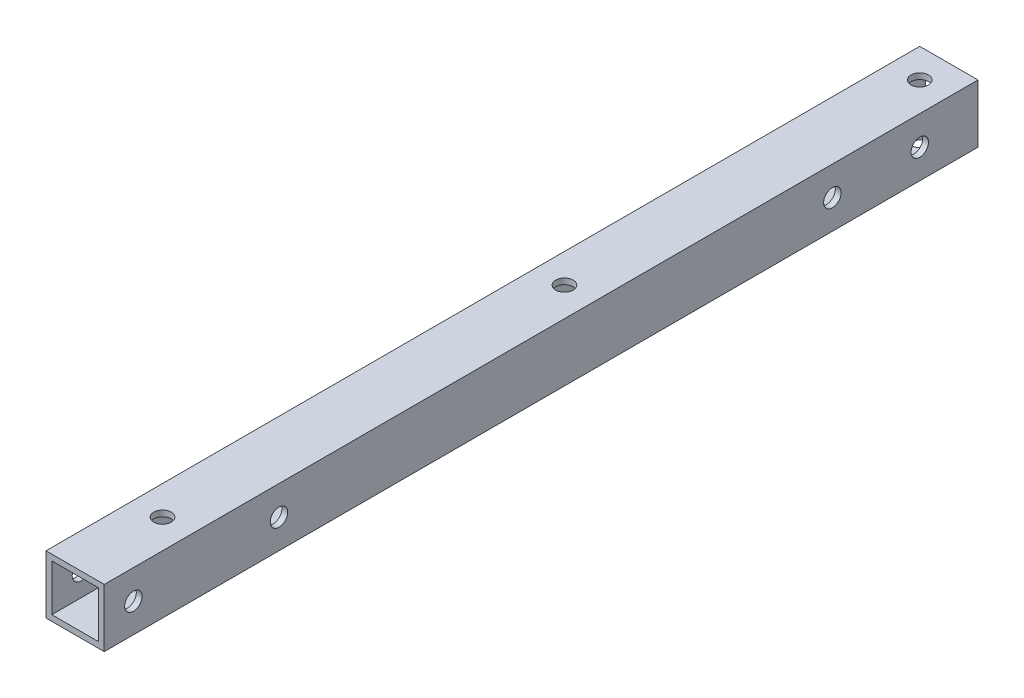
ISO-10303-21;
HEADER;
FILE_DESCRIPTION(('STEP AP214'),'2;1');
FILE_NAME('part.step','',(''),(''),'','','');
FILE_SCHEMA(('AUTOMOTIVE_DESIGN { 1 0 10303 214 1 1 1 1 }'));
ENDSEC;
DATA;
#1=APPLICATION_CONTEXT('core data for automotive mechanical design processes');
#2=APPLICATION_PROTOCOL_DEFINITION('international standard','automotive_design',2000,#1);
#3=PRODUCT_CONTEXT('',#1,'mechanical');
#4=PRODUCT('Part','Part','',(#3));
#5=PRODUCT_RELATED_PRODUCT_CATEGORY('part','',(#4));
#6=PRODUCT_DEFINITION_FORMATION('','',#4);
#7=PRODUCT_DEFINITION_CONTEXT('part definition',#1,'design');
#8=PRODUCT_DEFINITION('design','',#6,#7);
#9=PRODUCT_DEFINITION_SHAPE('','',#8);
#10=(LENGTH_UNIT() NAMED_UNIT(*) SI_UNIT(.MILLI.,.METRE.));
#11=(NAMED_UNIT(*) PLANE_ANGLE_UNIT() SI_UNIT($,.RADIAN.));
#12=(NAMED_UNIT(*) SI_UNIT($,.STERADIAN.) SOLID_ANGLE_UNIT());
#13=UNCERTAINTY_MEASURE_WITH_UNIT(LENGTH_MEASURE(1.E-05),#10,'distance_accuracy_value','');
#14=(GEOMETRIC_REPRESENTATION_CONTEXT(3) GLOBAL_UNCERTAINTY_ASSIGNED_CONTEXT((#13)) GLOBAL_UNIT_ASSIGNED_CONTEXT((#10,
#11,#12)) REPRESENTATION_CONTEXT('',''));
#15=CARTESIAN_POINT('',(0.,0.,0.));
#16=DIRECTION('',(0.,0.,1.));
#17=DIRECTION('',(1.,0.,0.));
#18=AXIS2_PLACEMENT_3D('',#15,#16,#17);
#19=CARTESIAN_POINT('',(0.,0.,150.));
#20=DIRECTION('',(0.,0.,1.));
#21=DIRECTION('',(1.,0.,0.));
#22=AXIS2_PLACEMENT_3D('',#19,#20,#21);
#23=PLANE('',#22);
#24=DIRECTION('',(0.,1.,0.));
#25=VECTOR('',#24,1.);
#26=CARTESIAN_POINT('',(9.16108929283946,-154.11274533603,150.));
#27=LINE('',#26,#25);
#28=CARTESIAN_POINT('',(9.16108929283946,-164.11274533603,150.));
#29=VERTEX_POINT('',#28);
#30=CARTESIAN_POINT('',(9.16108929283946,-154.11274533603,150.));
#31=VERTEX_POINT('',#30);
#32=EDGE_CURVE('E168',#29,#31,#27,.T.);
#33=ORIENTED_EDGE('',*,*,#32,.T.);
#34=DIRECTION('',(-1.,0.,0.));
#35=VECTOR('',#34,1.);
#36=CARTESIAN_POINT('',(9.16108929283946,-154.11274533603,150.));
#37=LINE('',#36,#35);
#38=CARTESIAN_POINT('',(-0.838910707160541,-154.11274533603,150.));
#39=VERTEX_POINT('',#38);
#40=EDGE_CURVE('E171',#31,#39,#37,.T.);
#41=ORIENTED_EDGE('',*,*,#40,.T.);
#42=DIRECTION('',(0.,-1.,0.));
#43=VECTOR('',#42,1.);
#44=CARTESIAN_POINT('',(-0.838910707160541,-154.11274533603,150.));
#45=LINE('',#44,#43);
#46=CARTESIAN_POINT('',(-0.838910707160538,-164.11274533603,150.));
#47=VERTEX_POINT('',#46);
#48=EDGE_CURVE('E174',#39,#47,#45,.T.);
#49=ORIENTED_EDGE('',*,*,#48,.T.);
#50=DIRECTION('',(1.,0.,0.));
#51=VECTOR('',#50,1.);
#52=CARTESIAN_POINT('',(9.16108929283946,-164.11274533603,150.));
#53=LINE('',#52,#51);
#54=EDGE_CURVE('E176',#47,#29,#53,.T.);
#55=ORIENTED_EDGE('',*,*,#54,.T.);
#56=EDGE_LOOP('',(#33,#41,#49,#55));
#57=FACE_BOUND('',#56,.T.);
#58=DIRECTION('',(-1.,0.,0.));
#59=VECTOR('',#58,1.);
#60=CARTESIAN_POINT('',(0.,-155.11274533603,150.));
#61=LINE('',#60,#59);
#62=CARTESIAN_POINT('',(8.16108929283946,-155.11274533603,150.));
#63=VERTEX_POINT('',#62);
#64=CARTESIAN_POINT('',(0.161089292839459,-155.11274533603,150.));
#65=VERTEX_POINT('',#64);
#66=EDGE_CURVE('E138',#63,#65,#61,.T.);
#67=ORIENTED_EDGE('',*,*,#66,.F.);
#68=DIRECTION('',(0.,1.,0.));
#69=VECTOR('',#68,1.);
#70=CARTESIAN_POINT('',(8.16108929283946,0.,150.));
#71=LINE('',#70,#69);
#72=CARTESIAN_POINT('',(8.16108929283946,-163.11274533603,150.));
#73=VERTEX_POINT('',#72);
#74=EDGE_CURVE('E130',#73,#63,#71,.T.);
#75=ORIENTED_EDGE('',*,*,#74,.F.);
#76=DIRECTION('',(1.,0.,0.));
#77=VECTOR('',#76,1.);
#78=CARTESIAN_POINT('',(0.,-163.11274533603,150.));
#79=LINE('',#78,#77);
#80=CARTESIAN_POINT('',(0.161089292839462,-163.11274533603,150.));
#81=VERTEX_POINT('',#80);
#82=EDGE_CURVE('E152',#81,#73,#79,.T.);
#83=ORIENTED_EDGE('',*,*,#82,.F.);
#84=DIRECTION('',(0.,-1.,0.));
#85=VECTOR('',#84,1.);
#86=CARTESIAN_POINT('',(0.161089292839405,0.,150.));
#87=LINE('',#86,#85);
#88=EDGE_CURVE('E150',#65,#81,#87,.T.);
#89=ORIENTED_EDGE('',*,*,#88,.F.);
#90=EDGE_LOOP('',(#67,#75,#83,#89));
#91=FACE_BOUND('',#90,.T.);
#92=ADVANCED_FACE('F63',(#57,#91),#23,.T.);
#93=CARTESIAN_POINT('',(0.,0.,0.));
#94=DIRECTION('',(0.,0.,1.));
#95=DIRECTION('',(1.,0.,0.));
#96=AXIS2_PLACEMENT_3D('',#93,#94,#95);
#97=PLANE('',#96);
#98=DIRECTION('',(0.,1.,0.));
#99=VECTOR('',#98,1.);
#100=CARTESIAN_POINT('',(9.16108929283946,-154.11274533603,0.));
#101=LINE('',#100,#99);
#102=CARTESIAN_POINT('',(9.16108929283946,-164.11274533603,0.));
#103=VERTEX_POINT('',#102);
#104=CARTESIAN_POINT('',(9.16108929283946,-154.11274533603,0.));
#105=VERTEX_POINT('',#104);
#106=EDGE_CURVE('E146',#103,#105,#101,.T.);
#107=ORIENTED_EDGE('',*,*,#106,.F.);
#108=DIRECTION('',(1.,0.,0.));
#109=VECTOR('',#108,1.);
#110=CARTESIAN_POINT('',(9.16108929283946,-164.11274533603,0.));
#111=LINE('',#110,#109);
#112=CARTESIAN_POINT('',(-0.838910707160538,-164.11274533603,0.));
#113=VERTEX_POINT('',#112);
#114=EDGE_CURVE('E172',#113,#103,#111,.T.);
#115=ORIENTED_EDGE('',*,*,#114,.F.);
#116=DIRECTION('',(0.,-1.,0.));
#117=VECTOR('',#116,1.);
#118=CARTESIAN_POINT('',(-0.838910707160541,-154.11274533603,0.));
#119=LINE('',#118,#117);
#120=CARTESIAN_POINT('',(-0.838910707160541,-154.11274533603,0.));
#121=VERTEX_POINT('',#120);
#122=EDGE_CURVE('E183',#121,#113,#119,.T.);
#123=ORIENTED_EDGE('',*,*,#122,.F.);
#124=DIRECTION('',(-1.,0.,0.));
#125=VECTOR('',#124,1.);
#126=CARTESIAN_POINT('',(9.16108929283946,-154.11274533603,0.));
#127=LINE('',#126,#125);
#128=EDGE_CURVE('E181',#105,#121,#127,.T.);
#129=ORIENTED_EDGE('',*,*,#128,.F.);
#130=EDGE_LOOP('',(#107,#115,#123,#129));
#131=FACE_BOUND('',#130,.T.);
#132=DIRECTION('',(0.,1.,0.));
#133=VECTOR('',#132,1.);
#134=CARTESIAN_POINT('',(8.16108929283946,0.,0.));
#135=LINE('',#134,#133);
#136=CARTESIAN_POINT('',(8.16108929283946,-163.11274533603,0.));
#137=VERTEX_POINT('',#136);
#138=CARTESIAN_POINT('',(8.16108929283946,-155.11274533603,0.));
#139=VERTEX_POINT('',#138);
#140=EDGE_CURVE('E88',#137,#139,#135,.T.);
#141=ORIENTED_EDGE('',*,*,#140,.T.);
#142=DIRECTION('',(-1.,0.,0.));
#143=VECTOR('',#142,1.);
#144=CARTESIAN_POINT('',(0.,-155.11274533603,0.));
#145=LINE('',#144,#143);
#146=CARTESIAN_POINT('',(0.161089292839459,-155.11274533603,0.));
#147=VERTEX_POINT('',#146);
#148=EDGE_CURVE('E145',#139,#147,#145,.T.);
#149=ORIENTED_EDGE('',*,*,#148,.T.);
#150=DIRECTION('',(0.,-1.,0.));
#151=VECTOR('',#150,1.);
#152=CARTESIAN_POINT('',(0.161089292839405,0.,0.));
#153=LINE('',#152,#151);
#154=CARTESIAN_POINT('',(0.161089292839462,-163.11274533603,0.));
#155=VERTEX_POINT('',#154);
#156=EDGE_CURVE('E160',#147,#155,#153,.T.);
#157=ORIENTED_EDGE('',*,*,#156,.T.);
#158=DIRECTION('',(1.,0.,0.));
#159=VECTOR('',#158,1.);
#160=CARTESIAN_POINT('',(0.,-163.11274533603,0.));
#161=LINE('',#160,#159);
#162=EDGE_CURVE('E139',#155,#137,#161,.T.);
#163=ORIENTED_EDGE('',*,*,#162,.T.);
#164=EDGE_LOOP('',(#141,#149,#157,#163));
#165=FACE_BOUND('',#164,.T.);
#166=ADVANCED_FACE('F287',(#131,#165),#97,.F.);
#167=CARTESIAN_POINT('',(9.16108929283946,-154.11274533603,150.));
#168=DIRECTION('',(-1.,0.,0.));
#169=DIRECTION('',(0.,0.,1.));
#170=AXIS2_PLACEMENT_3D('',#167,#168,#169);
#171=PLANE('',#170);
#172=CARTESIAN_POINT('',(9.16108929283946,-159.11274533603,145.));
#173=DIRECTION('',(1.,0.,0.));
#174=DIRECTION('',(0.,0.,-1.));
#175=AXIS2_PLACEMENT_3D('',#172,#173,#174);
#176=CIRCLE('',#175,1.5);
#177=CARTESIAN_POINT('',(9.16108929283946,-159.11274533603,143.5));
#178=VERTEX_POINT('',#177);
#179=EDGE_CURVE('E332',#178,#178,#176,.T.);
#180=ORIENTED_EDGE('',*,*,#179,.F.);
#181=EDGE_LOOP('',(#180));
#182=FACE_BOUND('',#181,.T.);
#183=CARTESIAN_POINT('',(9.16108929283946,-159.11274533603,120.));
#184=DIRECTION('',(1.,0.,0.));
#185=DIRECTION('',(0.,0.,-1.));
#186=AXIS2_PLACEMENT_3D('',#183,#184,#185);
#187=CIRCLE('',#186,1.49999999999978);
#188=CARTESIAN_POINT('',(9.16108929283946,-159.11274533603,118.5));
#189=VERTEX_POINT('',#188);
#190=EDGE_CURVE('E336',#189,#189,#187,.T.);
#191=ORIENTED_EDGE('',*,*,#190,.F.);
#192=EDGE_LOOP('',(#191));
#193=FACE_BOUND('',#192,.T.);
#194=CARTESIAN_POINT('',(9.16108929283946,-159.11274533603,10.));
#195=DIRECTION('',(1.,0.,0.));
#196=DIRECTION('',(0.,0.,-1.));
#197=AXIS2_PLACEMENT_3D('',#194,#195,#196);
#198=CIRCLE('',#197,1.5);
#199=CARTESIAN_POINT('',(9.16108929283946,-159.11274533603,8.5));
#200=VERTEX_POINT('',#199);
#201=EDGE_CURVE('E329',#200,#200,#198,.T.);
#202=ORIENTED_EDGE('',*,*,#201,.F.);
#203=EDGE_LOOP('',(#202));
#204=FACE_BOUND('',#203,.T.);
#205=CARTESIAN_POINT('',(9.16108929283946,-159.11274533603,25.));
#206=DIRECTION('',(1.,0.,0.));
#207=DIRECTION('',(0.,0.,-1.));
#208=AXIS2_PLACEMENT_3D('',#205,#206,#207);
#209=CIRCLE('',#208,1.5);
#210=CARTESIAN_POINT('',(9.16108929283946,-159.11274533603,23.5));
#211=VERTEX_POINT('',#210);
#212=EDGE_CURVE('E326',#211,#211,#209,.T.);
#213=ORIENTED_EDGE('',*,*,#212,.F.);
#214=EDGE_LOOP('',(#213));
#215=FACE_BOUND('',#214,.T.);
#216=ORIENTED_EDGE('',*,*,#106,.T.);
#217=DIRECTION('',(0.,0.,-1.));
#218=VECTOR('',#217,1.);
#219=CARTESIAN_POINT('',(9.16108929283946,-154.11274533603,150.));
#220=LINE('',#219,#218);
#221=EDGE_CURVE('E12',#31,#105,#220,.T.);
#222=ORIENTED_EDGE('',*,*,#221,.F.);
#223=ORIENTED_EDGE('',*,*,#32,.F.);
#224=DIRECTION('',(0.,0.,-1.));
#225=VECTOR('',#224,1.);
#226=CARTESIAN_POINT('',(9.16108929283946,-164.11274533603,150.));
#227=LINE('',#226,#225);
#228=EDGE_CURVE('E178',#29,#103,#227,.T.);
#229=ORIENTED_EDGE('',*,*,#228,.T.);
#230=EDGE_LOOP('',(#216,#222,#223,#229));
#231=FACE_BOUND('',#230,.T.);
#232=ADVANCED_FACE('F65',(#182,#193,#204,#215,#231),#171,.F.);
#233=CARTESIAN_POINT('',(9.16108929283946,-154.11274533603,150.));
#234=DIRECTION('',(0.,-1.,0.));
#235=DIRECTION('',(0.,0.,-1.));
#236=AXIS2_PLACEMENT_3D('',#233,#234,#235);
#237=PLANE('',#236);
#238=CARTESIAN_POINT('',(4.16108929283948,-154.11274533603,5.));
#239=DIRECTION('',(0.,-1.,0.));
#240=DIRECTION('',(0.,0.,-1.));
#241=AXIS2_PLACEMENT_3D('',#238,#239,#240);
#242=CIRCLE('',#241,1.5);
#243=CARTESIAN_POINT('',(4.16108929283948,-154.11274533603,3.5));
#244=VERTEX_POINT('',#243);
#245=EDGE_CURVE('E197',#244,#244,#242,.T.);
#246=ORIENTED_EDGE('',*,*,#245,.T.);
#247=EDGE_LOOP('',(#246));
#248=FACE_BOUND('',#247,.T.);
#249=CARTESIAN_POINT('',(4.16108929283946,-154.11274533603,135.));
#250=DIRECTION('',(0.,-1.,0.));
#251=DIRECTION('',(0.,0.,-1.));
#252=AXIS2_PLACEMENT_3D('',#249,#250,#251);
#253=CIRCLE('',#252,1.5);
#254=CARTESIAN_POINT('',(4.16108929283946,-154.11274533603,133.5));
#255=VERTEX_POINT('',#254);
#256=EDGE_CURVE('E239',#255,#255,#253,.T.);
#257=ORIENTED_EDGE('',*,*,#256,.T.);
#258=EDGE_LOOP('',(#257));
#259=FACE_BOUND('',#258,.T.);
#260=CARTESIAN_POINT('',(4.16108929283947,-154.11274533603,66.));
#261=DIRECTION('',(0.,-1.,0.));
#262=DIRECTION('',(0.,0.,-1.));
#263=AXIS2_PLACEMENT_3D('',#260,#261,#262);
#264=CIRCLE('',#263,1.5);
#265=CARTESIAN_POINT('',(4.16108929283947,-154.11274533603,64.5));
#266=VERTEX_POINT('',#265);
#267=EDGE_CURVE('E230',#266,#266,#264,.T.);
#268=ORIENTED_EDGE('',*,*,#267,.T.);
#269=EDGE_LOOP('',(#268));
#270=FACE_BOUND('',#269,.T.);
#271=ORIENTED_EDGE('',*,*,#128,.T.);
#272=DIRECTION('',(0.,0.,-1.));
#273=VECTOR('',#272,1.);
#274=CARTESIAN_POINT('',(-0.838910707160541,-154.11274533603,150.));
#275=LINE('',#274,#273);
#276=EDGE_CURVE('E72',#39,#121,#275,.T.);
#277=ORIENTED_EDGE('',*,*,#276,.F.);
#278=ORIENTED_EDGE('',*,*,#40,.F.);
#279=ORIENTED_EDGE('',*,*,#221,.T.);
#280=EDGE_LOOP('',(#271,#277,#278,#279));
#281=FACE_BOUND('',#280,.T.);
#282=ADVANCED_FACE('F273',(#248,#259,#270,#281),#237,.F.);
#283=CARTESIAN_POINT('',(-0.838910707160541,-154.11274533603,150.));
#284=DIRECTION('',(1.,0.,0.));
#285=DIRECTION('',(0.,1.,0.));
#286=AXIS2_PLACEMENT_3D('',#283,#284,#285);
#287=PLANE('',#286);
#288=CARTESIAN_POINT('',(-0.83891070716054,-159.11274533603,145.));
#289=DIRECTION('',(1.,0.,0.));
#290=DIRECTION('',(0.,0.,-1.));
#291=AXIS2_PLACEMENT_3D('',#288,#289,#290);
#292=CIRCLE('',#291,1.5);
#293=CARTESIAN_POINT('',(-0.83891070716054,-159.11274533603,143.5));
#294=VERTEX_POINT('',#293);
#295=EDGE_CURVE('E314',#294,#294,#292,.T.);
#296=ORIENTED_EDGE('',*,*,#295,.T.);
#297=EDGE_LOOP('',(#296));
#298=FACE_BOUND('',#297,.T.);
#299=CARTESIAN_POINT('',(-0.83891070716054,-159.11274533603,120.));
#300=DIRECTION('',(1.,0.,0.));
#301=DIRECTION('',(0.,0.,-1.));
#302=AXIS2_PLACEMENT_3D('',#299,#300,#301);
#303=CIRCLE('',#302,1.49999999999978);
#304=CARTESIAN_POINT('',(-0.83891070716054,-159.11274533603,118.5));
#305=VERTEX_POINT('',#304);
#306=EDGE_CURVE('E318',#305,#305,#303,.T.);
#307=ORIENTED_EDGE('',*,*,#306,.T.);
#308=EDGE_LOOP('',(#307));
#309=FACE_BOUND('',#308,.T.);
#310=CARTESIAN_POINT('',(-0.83891070716054,-159.11274533603,10.));
#311=DIRECTION('',(1.,0.,0.));
#312=DIRECTION('',(0.,0.,-1.));
#313=AXIS2_PLACEMENT_3D('',#310,#311,#312);
#314=CIRCLE('',#313,1.5);
#315=CARTESIAN_POINT('',(-0.83891070716054,-159.11274533603,8.5));
#316=VERTEX_POINT('',#315);
#317=EDGE_CURVE('E322',#316,#316,#314,.T.);
#318=ORIENTED_EDGE('',*,*,#317,.T.);
#319=EDGE_LOOP('',(#318));
#320=FACE_BOUND('',#319,.T.);
#321=CARTESIAN_POINT('',(-0.83891070716054,-159.11274533603,25.));
#322=DIRECTION('',(1.,0.,0.));
#323=DIRECTION('',(0.,0.,-1.));
#324=AXIS2_PLACEMENT_3D('',#321,#322,#323);
#325=CIRCLE('',#324,1.5);
#326=CARTESIAN_POINT('',(-0.83891070716054,-159.11274533603,23.5));
#327=VERTEX_POINT('',#326);
#328=EDGE_CURVE('E209',#327,#327,#325,.T.);
#329=ORIENTED_EDGE('',*,*,#328,.T.);
#330=EDGE_LOOP('',(#329));
#331=FACE_BOUND('',#330,.T.);
#332=ORIENTED_EDGE('',*,*,#122,.T.);
#333=DIRECTION('',(0.,0.,-1.));
#334=VECTOR('',#333,1.);
#335=CARTESIAN_POINT('',(-0.838910707160538,-164.11274533603,150.));
#336=LINE('',#335,#334);
#337=EDGE_CURVE('E188',#47,#113,#336,.T.);
#338=ORIENTED_EDGE('',*,*,#337,.F.);
#339=ORIENTED_EDGE('',*,*,#48,.F.);
#340=ORIENTED_EDGE('',*,*,#276,.T.);
#341=EDGE_LOOP('',(#332,#338,#339,#340));
#342=FACE_BOUND('',#341,.T.);
#343=ADVANCED_FACE('F276',(#298,#309,#320,#331,#342),#287,.F.);
#344=CARTESIAN_POINT('',(9.16108929283946,-164.11274533603,150.));
#345=DIRECTION('',(0.,1.,0.));
#346=DIRECTION('',(0.,0.,1.));
#347=AXIS2_PLACEMENT_3D('',#344,#345,#346);
#348=PLANE('',#347);
#349=CARTESIAN_POINT('',(4.16108929283948,-164.11274533603,5.));
#350=DIRECTION('',(0.,-1.,0.));
#351=DIRECTION('',(0.,0.,-1.));
#352=AXIS2_PLACEMENT_3D('',#349,#350,#351);
#353=CIRCLE('',#352,1.5);
#354=CARTESIAN_POINT('',(4.16108929283948,-164.11274533603,3.5));
#355=VERTEX_POINT('',#354);
#356=EDGE_CURVE('E233',#355,#355,#353,.T.);
#357=ORIENTED_EDGE('',*,*,#356,.F.);
#358=EDGE_LOOP('',(#357));
#359=FACE_BOUND('',#358,.T.);
#360=CARTESIAN_POINT('',(4.16108929283946,-164.11274533603,135.));
#361=DIRECTION('',(0.,-1.,0.));
#362=DIRECTION('',(0.,0.,-1.));
#363=AXIS2_PLACEMENT_3D('',#360,#361,#362);
#364=CIRCLE('',#363,1.5);
#365=CARTESIAN_POINT('',(4.16108929283946,-164.11274533603,133.5));
#366=VERTEX_POINT('',#365);
#367=EDGE_CURVE('E236',#366,#366,#364,.T.);
#368=ORIENTED_EDGE('',*,*,#367,.F.);
#369=EDGE_LOOP('',(#368));
#370=FACE_BOUND('',#369,.T.);
#371=CARTESIAN_POINT('',(4.16108929283947,-164.11274533603,66.));
#372=DIRECTION('',(0.,-1.,0.));
#373=DIRECTION('',(0.,0.,-1.));
#374=AXIS2_PLACEMENT_3D('',#371,#372,#373);
#375=CIRCLE('',#374,1.5);
#376=CARTESIAN_POINT('',(4.16108929283947,-164.11274533603,64.5));
#377=VERTEX_POINT('',#376);
#378=EDGE_CURVE('E242',#377,#377,#375,.T.);
#379=ORIENTED_EDGE('',*,*,#378,.F.);
#380=EDGE_LOOP('',(#379));
#381=FACE_BOUND('',#380,.T.);
#382=ORIENTED_EDGE('',*,*,#114,.T.);
#383=ORIENTED_EDGE('',*,*,#228,.F.);
#384=ORIENTED_EDGE('',*,*,#54,.F.);
#385=ORIENTED_EDGE('',*,*,#337,.T.);
#386=EDGE_LOOP('',(#382,#383,#384,#385));
#387=FACE_BOUND('',#386,.T.);
#388=ADVANCED_FACE('F291',(#359,#370,#381,#387),#348,.F.);
#389=CARTESIAN_POINT('',(8.16108929283946,0.,150.));
#390=DIRECTION('',(-1.,0.,0.));
#391=DIRECTION('',(0.,0.,1.));
#392=AXIS2_PLACEMENT_3D('',#389,#390,#391);
#393=PLANE('',#392);
#394=CARTESIAN_POINT('',(8.16108929283946,-159.11274533603,145.));
#395=DIRECTION('',(-1.,0.,0.));
#396=DIRECTION('',(0.,0.,1.));
#397=AXIS2_PLACEMENT_3D('',#394,#395,#396);
#398=CIRCLE('',#397,1.5);
#399=CARTESIAN_POINT('',(8.16108929283946,-159.11274533603,146.5));
#400=VERTEX_POINT('',#399);
#401=EDGE_CURVE('E227',#400,#400,#398,.T.);
#402=ORIENTED_EDGE('',*,*,#401,.F.);
#403=EDGE_LOOP('',(#402));
#404=FACE_BOUND('',#403,.T.);
#405=CARTESIAN_POINT('',(8.16108929283946,-159.11274533603,120.));
#406=DIRECTION('',(-1.,0.,0.));
#407=DIRECTION('',(0.,0.,1.));
#408=AXIS2_PLACEMENT_3D('',#405,#406,#407);
#409=CIRCLE('',#408,1.49999999999978);
#410=CARTESIAN_POINT('',(8.16108929283946,-159.11274533603,121.5));
#411=VERTEX_POINT('',#410);
#412=EDGE_CURVE('E215',#411,#411,#409,.T.);
#413=ORIENTED_EDGE('',*,*,#412,.F.);
#414=EDGE_LOOP('',(#413));
#415=FACE_BOUND('',#414,.T.);
#416=CARTESIAN_POINT('',(8.16108929283946,-159.11274533603,10.));
#417=DIRECTION('',(-1.,0.,0.));
#418=DIRECTION('',(0.,0.,1.));
#419=AXIS2_PLACEMENT_3D('',#416,#417,#418);
#420=CIRCLE('',#419,1.5);
#421=CARTESIAN_POINT('',(8.16108929283946,-159.11274533603,11.5));
#422=VERTEX_POINT('',#421);
#423=EDGE_CURVE('E212',#422,#422,#420,.T.);
#424=ORIENTED_EDGE('',*,*,#423,.F.);
#425=EDGE_LOOP('',(#424));
#426=FACE_BOUND('',#425,.T.);
#427=CARTESIAN_POINT('',(8.16108929283946,-159.11274533603,25.));
#428=DIRECTION('',(-1.,0.,0.));
#429=DIRECTION('',(0.,0.,1.));
#430=AXIS2_PLACEMENT_3D('',#427,#428,#429);
#431=CIRCLE('',#430,1.5);
#432=CARTESIAN_POINT('',(8.16108929283946,-159.11274533603,26.5));
#433=VERTEX_POINT('',#432);
#434=EDGE_CURVE('E208',#433,#433,#431,.T.);
#435=ORIENTED_EDGE('',*,*,#434,.F.);
#436=EDGE_LOOP('',(#435));
#437=FACE_BOUND('',#436,.T.);
#438=ORIENTED_EDGE('',*,*,#140,.F.);
#439=DIRECTION('',(0.,0.,-1.));
#440=VECTOR('',#439,1.);
#441=CARTESIAN_POINT('',(8.16108929283946,-163.11274533603,150.));
#442=LINE('',#441,#440);
#443=EDGE_CURVE('E134',#73,#137,#442,.T.);
#444=ORIENTED_EDGE('',*,*,#443,.F.);
#445=ORIENTED_EDGE('',*,*,#74,.T.);
#446=DIRECTION('',(0.,0.,-1.));
#447=VECTOR('',#446,1.);
#448=CARTESIAN_POINT('',(8.16108929283946,-155.11274533603,150.));
#449=LINE('',#448,#447);
#450=EDGE_CURVE('E133',#63,#139,#449,.T.);
#451=ORIENTED_EDGE('',*,*,#450,.T.);
#452=EDGE_LOOP('',(#438,#444,#445,#451));
#453=FACE_BOUND('',#452,.T.);
#454=ADVANCED_FACE('F132',(#404,#415,#426,#437,#453),#393,.T.);
#455=CARTESIAN_POINT('',(0.,-155.11274533603,150.));
#456=DIRECTION('',(0.,-1.,0.));
#457=DIRECTION('',(0.,0.,-1.));
#458=AXIS2_PLACEMENT_3D('',#455,#456,#457);
#459=PLANE('',#458);
#460=CARTESIAN_POINT('',(4.16108929283948,-155.11274533603,5.));
#461=DIRECTION('',(0.,-1.,0.));
#462=DIRECTION('',(0.,0.,-1.));
#463=AXIS2_PLACEMENT_3D('',#460,#461,#462);
#464=CIRCLE('',#463,1.5);
#465=CARTESIAN_POINT('',(4.16108929283948,-155.11274533603,3.5));
#466=VERTEX_POINT('',#465);
#467=EDGE_CURVE('E158',#466,#466,#464,.T.);
#468=ORIENTED_EDGE('',*,*,#467,.F.);
#469=EDGE_LOOP('',(#468));
#470=FACE_BOUND('',#469,.T.);
#471=CARTESIAN_POINT('',(4.16108929283946,-155.11274533603,135.));
#472=DIRECTION('',(0.,-1.,0.));
#473=DIRECTION('',(0.,0.,-1.));
#474=AXIS2_PLACEMENT_3D('',#471,#472,#473);
#475=CIRCLE('',#474,1.5);
#476=CARTESIAN_POINT('',(4.16108929283946,-155.11274533603,133.5));
#477=VERTEX_POINT('',#476);
#478=EDGE_CURVE('E201',#477,#477,#475,.T.);
#479=ORIENTED_EDGE('',*,*,#478,.F.);
#480=EDGE_LOOP('',(#479));
#481=FACE_BOUND('',#480,.T.);
#482=CARTESIAN_POINT('',(4.16108929283947,-155.11274533603,66.));
#483=DIRECTION('',(0.,-1.,0.));
#484=DIRECTION('',(0.,0.,-1.));
#485=AXIS2_PLACEMENT_3D('',#482,#483,#484);
#486=CIRCLE('',#485,1.5);
#487=CARTESIAN_POINT('',(4.16108929283947,-155.11274533603,64.5));
#488=VERTEX_POINT('',#487);
#489=EDGE_CURVE('E196',#488,#488,#486,.T.);
#490=ORIENTED_EDGE('',*,*,#489,.F.);
#491=EDGE_LOOP('',(#490));
#492=FACE_BOUND('',#491,.T.);
#493=ORIENTED_EDGE('',*,*,#148,.F.);
#494=ORIENTED_EDGE('',*,*,#450,.F.);
#495=ORIENTED_EDGE('',*,*,#66,.T.);
#496=DIRECTION('',(0.,0.,-1.));
#497=VECTOR('',#496,1.);
#498=CARTESIAN_POINT('',(0.161089292839459,-155.11274533603,150.));
#499=LINE('',#498,#497);
#500=EDGE_CURVE('E147',#65,#147,#499,.T.);
#501=ORIENTED_EDGE('',*,*,#500,.T.);
#502=EDGE_LOOP('',(#493,#494,#495,#501));
#503=FACE_BOUND('',#502,.T.);
#504=ADVANCED_FACE('F142',(#470,#481,#492,#503),#459,.T.);
#505=CARTESIAN_POINT('',(0.161089292839405,0.,150.));
#506=DIRECTION('',(1.,0.,0.));
#507=DIRECTION('',(0.,1.,0.));
#508=AXIS2_PLACEMENT_3D('',#505,#506,#507);
#509=PLANE('',#508);
#510=CARTESIAN_POINT('',(0.161089292839461,-159.11274533603,145.));
#511=DIRECTION('',(1.,0.,0.));
#512=DIRECTION('',(0.,1.,0.));
#513=AXIS2_PLACEMENT_3D('',#510,#511,#512);
#514=CIRCLE('',#513,1.5);
#515=CARTESIAN_POINT('',(0.16108929283946,-157.61274533603,145.));
#516=VERTEX_POINT('',#515);
#517=EDGE_CURVE('E67',#516,#516,#514,.T.);
#518=ORIENTED_EDGE('',*,*,#517,.F.);
#519=EDGE_LOOP('',(#518));
#520=FACE_BOUND('',#519,.T.);
#521=CARTESIAN_POINT('',(0.161089292839461,-159.11274533603,120.));
#522=DIRECTION('',(1.,0.,0.));
#523=DIRECTION('',(0.,1.,0.));
#524=AXIS2_PLACEMENT_3D('',#521,#522,#523);
#525=CIRCLE('',#524,1.49999999999978);
#526=CARTESIAN_POINT('',(0.16108929283946,-157.612745336031,120.));
#527=VERTEX_POINT('',#526);
#528=EDGE_CURVE('E213',#527,#527,#525,.T.);
#529=ORIENTED_EDGE('',*,*,#528,.F.);
#530=EDGE_LOOP('',(#529));
#531=FACE_BOUND('',#530,.T.);
#532=CARTESIAN_POINT('',(0.161089292839461,-159.11274533603,10.));
#533=DIRECTION('',(1.,0.,0.));
#534=DIRECTION('',(0.,1.,0.));
#535=AXIS2_PLACEMENT_3D('',#532,#533,#534);
#536=CIRCLE('',#535,1.5);
#537=CARTESIAN_POINT('',(0.16108929283946,-157.61274533603,10.));
#538=VERTEX_POINT('',#537);
#539=EDGE_CURVE('E210',#538,#538,#536,.T.);
#540=ORIENTED_EDGE('',*,*,#539,.F.);
#541=EDGE_LOOP('',(#540));
#542=FACE_BOUND('',#541,.T.);
#543=CARTESIAN_POINT('',(0.161089292839461,-159.11274533603,25.));
#544=DIRECTION('',(1.,0.,0.));
#545=DIRECTION('',(0.,1.,0.));
#546=AXIS2_PLACEMENT_3D('',#543,#544,#545);
#547=CIRCLE('',#546,1.5);
#548=CARTESIAN_POINT('',(0.16108929283946,-157.61274533603,25.));
#549=VERTEX_POINT('',#548);
#550=EDGE_CURVE('E205',#549,#549,#547,.T.);
#551=ORIENTED_EDGE('',*,*,#550,.F.);
#552=EDGE_LOOP('',(#551));
#553=FACE_BOUND('',#552,.T.);
#554=ORIENTED_EDGE('',*,*,#156,.F.);
#555=ORIENTED_EDGE('',*,*,#500,.F.);
#556=ORIENTED_EDGE('',*,*,#88,.T.);
#557=DIRECTION('',(0.,0.,-1.));
#558=VECTOR('',#557,1.);
#559=CARTESIAN_POINT('',(0.161089292839462,-163.11274533603,150.));
#560=LINE('',#559,#558);
#561=EDGE_CURVE('E80',#81,#155,#560,.T.);
#562=ORIENTED_EDGE('',*,*,#561,.T.);
#563=EDGE_LOOP('',(#554,#555,#556,#562));
#564=FACE_BOUND('',#563,.T.);
#565=ADVANCED_FACE('F258',(#520,#531,#542,#553,#564),#509,.T.);
#566=CARTESIAN_POINT('',(0.,-163.11274533603,150.));
#567=DIRECTION('',(0.,1.,0.));
#568=DIRECTION('',(0.,0.,1.));
#569=AXIS2_PLACEMENT_3D('',#566,#567,#568);
#570=PLANE('',#569);
#571=CARTESIAN_POINT('',(4.16108929283948,-163.11274533603,5.));
#572=DIRECTION('',(0.,1.,0.));
#573=DIRECTION('',(0.,0.,1.));
#574=AXIS2_PLACEMENT_3D('',#571,#572,#573);
#575=CIRCLE('',#574,1.5);
#576=CARTESIAN_POINT('',(4.16108929283948,-163.11274533603,6.5));
#577=VERTEX_POINT('',#576);
#578=EDGE_CURVE('E202',#577,#577,#575,.T.);
#579=ORIENTED_EDGE('',*,*,#578,.F.);
#580=EDGE_LOOP('',(#579));
#581=FACE_BOUND('',#580,.T.);
#582=CARTESIAN_POINT('',(4.16108929283946,-163.11274533603,135.));
#583=DIRECTION('',(0.,1.,0.));
#584=DIRECTION('',(0.,0.,1.));
#585=AXIS2_PLACEMENT_3D('',#582,#583,#584);
#586=CIRCLE('',#585,1.5);
#587=CARTESIAN_POINT('',(4.16108929283946,-163.11274533603,136.5));
#588=VERTEX_POINT('',#587);
#589=EDGE_CURVE('E198',#588,#588,#586,.T.);
#590=ORIENTED_EDGE('',*,*,#589,.F.);
#591=EDGE_LOOP('',(#590));
#592=FACE_BOUND('',#591,.T.);
#593=CARTESIAN_POINT('',(4.16108929283947,-163.11274533603,66.));
#594=DIRECTION('',(0.,1.,0.));
#595=DIRECTION('',(0.,0.,1.));
#596=AXIS2_PLACEMENT_3D('',#593,#594,#595);
#597=CIRCLE('',#596,1.5);
#598=CARTESIAN_POINT('',(4.16108929283947,-163.11274533603,67.5));
#599=VERTEX_POINT('',#598);
#600=EDGE_CURVE('E193',#599,#599,#597,.T.);
#601=ORIENTED_EDGE('',*,*,#600,.F.);
#602=EDGE_LOOP('',(#601));
#603=FACE_BOUND('',#602,.T.);
#604=ORIENTED_EDGE('',*,*,#162,.F.);
#605=ORIENTED_EDGE('',*,*,#561,.F.);
#606=ORIENTED_EDGE('',*,*,#82,.T.);
#607=ORIENTED_EDGE('',*,*,#443,.T.);
#608=EDGE_LOOP('',(#604,#605,#606,#607));
#609=FACE_BOUND('',#608,.T.);
#610=ADVANCED_FACE('F380',(#581,#592,#603,#609),#570,.T.);
#611=CARTESIAN_POINT('',(4.16108929283947,-154.11274533603,66.));
#612=DIRECTION('',(0.,-1.,0.));
#613=DIRECTION('',(0.,0.,-1.));
#614=AXIS2_PLACEMENT_3D('',#611,#612,#613);
#615=CYLINDRICAL_SURFACE('',#614,1.5);
#616=ORIENTED_EDGE('',*,*,#600,.T.);
#617=EDGE_LOOP('',(#616));
#618=FACE_BOUND('',#617,.T.);
#619=ORIENTED_EDGE('',*,*,#378,.T.);
#620=EDGE_LOOP('',(#619));
#621=FACE_BOUND('',#620,.T.);
#622=ADVANCED_FACE('F270',(#618,#621),#615,.F.);
#623=CARTESIAN_POINT('',(4.16108929283946,-154.11274533603,135.));
#624=DIRECTION('',(0.,-1.,0.));
#625=DIRECTION('',(0.,0.,-1.));
#626=AXIS2_PLACEMENT_3D('',#623,#624,#625);
#627=CYLINDRICAL_SURFACE('',#626,1.5);
#628=ORIENTED_EDGE('',*,*,#589,.T.);
#629=EDGE_LOOP('',(#628));
#630=FACE_BOUND('',#629,.T.);
#631=ORIENTED_EDGE('',*,*,#367,.T.);
#632=EDGE_LOOP('',(#631));
#633=FACE_BOUND('',#632,.T.);
#634=ADVANCED_FACE('F390',(#630,#633),#627,.F.);
#635=CARTESIAN_POINT('',(4.16108929283948,-154.11274533603,5.));
#636=DIRECTION('',(0.,-1.,0.));
#637=DIRECTION('',(0.,0.,-1.));
#638=AXIS2_PLACEMENT_3D('',#635,#636,#637);
#639=CYLINDRICAL_SURFACE('',#638,1.5);
#640=ORIENTED_EDGE('',*,*,#578,.T.);
#641=EDGE_LOOP('',(#640));
#642=FACE_BOUND('',#641,.T.);
#643=ORIENTED_EDGE('',*,*,#356,.T.);
#644=EDGE_LOOP('',(#643));
#645=FACE_BOUND('',#644,.T.);
#646=ADVANCED_FACE('F268',(#642,#645),#639,.F.);
#647=ORIENTED_EDGE('',*,*,#489,.T.);
#648=EDGE_LOOP('',(#647));
#649=FACE_BOUND('',#648,.T.);
#650=ORIENTED_EDGE('',*,*,#267,.F.);
#651=EDGE_LOOP('',(#650));
#652=FACE_BOUND('',#651,.T.);
#653=ADVANCED_FACE('F264',(#649,#652),#615,.F.);
#654=ORIENTED_EDGE('',*,*,#478,.T.);
#655=EDGE_LOOP('',(#654));
#656=FACE_BOUND('',#655,.T.);
#657=ORIENTED_EDGE('',*,*,#256,.F.);
#658=EDGE_LOOP('',(#657));
#659=FACE_BOUND('',#658,.T.);
#660=ADVANCED_FACE('F267',(#656,#659),#627,.F.);
#661=ORIENTED_EDGE('',*,*,#467,.T.);
#662=EDGE_LOOP('',(#661));
#663=FACE_BOUND('',#662,.T.);
#664=ORIENTED_EDGE('',*,*,#245,.F.);
#665=EDGE_LOOP('',(#664));
#666=FACE_BOUND('',#665,.T.);
#667=ADVANCED_FACE('F253',(#663,#666),#639,.F.);
#668=CARTESIAN_POINT('',(-0.83891070716054,-159.11274533603,25.));
#669=DIRECTION('',(1.,0.,0.));
#670=DIRECTION('',(0.,0.,-1.));
#671=AXIS2_PLACEMENT_3D('',#668,#669,#670);
#672=CYLINDRICAL_SURFACE('',#671,1.5);
#673=ORIENTED_EDGE('',*,*,#550,.T.);
#674=EDGE_LOOP('',(#673));
#675=FACE_BOUND('',#674,.T.);
#676=ORIENTED_EDGE('',*,*,#328,.F.);
#677=EDGE_LOOP('',(#676));
#678=FACE_BOUND('',#677,.T.);
#679=ADVANCED_FACE('F355',(#675,#678),#672,.F.);
#680=CARTESIAN_POINT('',(-0.83891070716054,-159.11274533603,10.));
#681=DIRECTION('',(1.,0.,0.));
#682=DIRECTION('',(0.,0.,-1.));
#683=AXIS2_PLACEMENT_3D('',#680,#681,#682);
#684=CYLINDRICAL_SURFACE('',#683,1.5);
#685=ORIENTED_EDGE('',*,*,#539,.T.);
#686=EDGE_LOOP('',(#685));
#687=FACE_BOUND('',#686,.T.);
#688=ORIENTED_EDGE('',*,*,#317,.F.);
#689=EDGE_LOOP('',(#688));
#690=FACE_BOUND('',#689,.T.);
#691=ADVANCED_FACE('F362',(#687,#690),#684,.F.);
#692=CARTESIAN_POINT('',(-0.83891070716054,-159.11274533603,120.));
#693=DIRECTION('',(1.,0.,0.));
#694=DIRECTION('',(0.,0.,-1.));
#695=AXIS2_PLACEMENT_3D('',#692,#693,#694);
#696=CYLINDRICAL_SURFACE('',#695,1.49999999999978);
#697=ORIENTED_EDGE('',*,*,#528,.T.);
#698=EDGE_LOOP('',(#697));
#699=FACE_BOUND('',#698,.T.);
#700=ORIENTED_EDGE('',*,*,#306,.F.);
#701=EDGE_LOOP('',(#700));
#702=FACE_BOUND('',#701,.T.);
#703=ADVANCED_FACE('F363',(#699,#702),#696,.F.);
#704=CARTESIAN_POINT('',(-0.83891070716054,-159.11274533603,145.));
#705=DIRECTION('',(1.,0.,0.));
#706=DIRECTION('',(0.,0.,-1.));
#707=AXIS2_PLACEMENT_3D('',#704,#705,#706);
#708=CYLINDRICAL_SURFACE('',#707,1.5);
#709=ORIENTED_EDGE('',*,*,#517,.T.);
#710=EDGE_LOOP('',(#709));
#711=FACE_BOUND('',#710,.T.);
#712=ORIENTED_EDGE('',*,*,#295,.F.);
#713=EDGE_LOOP('',(#712));
#714=FACE_BOUND('',#713,.T.);
#715=ADVANCED_FACE('F352',(#711,#714),#708,.F.);
#716=ORIENTED_EDGE('',*,*,#434,.T.);
#717=EDGE_LOOP('',(#716));
#718=FACE_BOUND('',#717,.T.);
#719=ORIENTED_EDGE('',*,*,#212,.T.);
#720=EDGE_LOOP('',(#719));
#721=FACE_BOUND('',#720,.T.);
#722=ADVANCED_FACE('F350',(#718,#721),#672,.F.);
#723=ORIENTED_EDGE('',*,*,#423,.T.);
#724=EDGE_LOOP('',(#723));
#725=FACE_BOUND('',#724,.T.);
#726=ORIENTED_EDGE('',*,*,#201,.T.);
#727=EDGE_LOOP('',(#726));
#728=FACE_BOUND('',#727,.T.);
#729=ADVANCED_FACE('F343',(#725,#728),#684,.F.);
#730=ORIENTED_EDGE('',*,*,#412,.T.);
#731=EDGE_LOOP('',(#730));
#732=FACE_BOUND('',#731,.T.);
#733=ORIENTED_EDGE('',*,*,#190,.T.);
#734=EDGE_LOOP('',(#733));
#735=FACE_BOUND('',#734,.T.);
#736=ADVANCED_FACE('F360',(#732,#735),#696,.F.);
#737=ORIENTED_EDGE('',*,*,#401,.T.);
#738=EDGE_LOOP('',(#737));
#739=FACE_BOUND('',#738,.T.);
#740=ORIENTED_EDGE('',*,*,#179,.T.);
#741=EDGE_LOOP('',(#740));
#742=FACE_BOUND('',#741,.T.);
#743=ADVANCED_FACE('F366',(#739,#742),#708,.F.);
#744=CLOSED_SHELL('',(#92,#166,#232,#282,#343,#388,#454,#504,#565,#610,#622,#634,#646,#653,#660,
#667,#679,#691,#703,#715,#722,#729,#736,#743));
#745=MANIFOLD_SOLID_BREP('B2',#744);
#746=ADVANCED_BREP_SHAPE_REPRESENTATION('',(#18,#745),#14);
#747=SHAPE_DEFINITION_REPRESENTATION(#9,#746);
ENDSEC;
END-ISO-10303-21;
